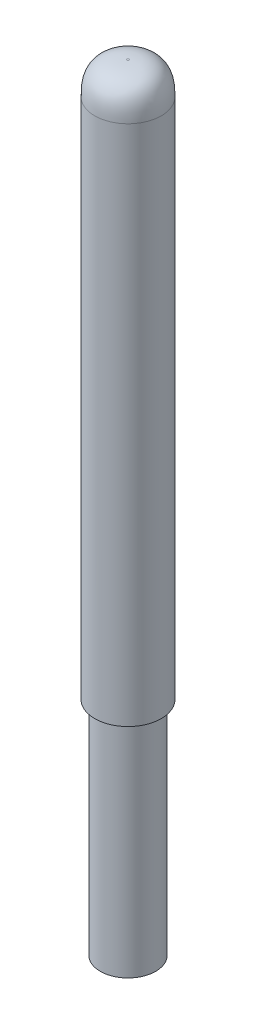
ISO-10303-21;
HEADER;
FILE_DESCRIPTION(('STEP AP214'),'2;1');
FILE_NAME('part.step','',(''),(''),'','','');
FILE_SCHEMA(('AUTOMOTIVE_DESIGN { 1 0 10303 214 1 1 1 1 }'));
ENDSEC;
DATA;
#1=APPLICATION_CONTEXT('core data for automotive mechanical design processes');
#2=APPLICATION_PROTOCOL_DEFINITION('international standard','automotive_design',2000,#1);
#3=PRODUCT_CONTEXT('',#1,'mechanical');
#4=PRODUCT('Part','Part','',(#3));
#5=PRODUCT_RELATED_PRODUCT_CATEGORY('part','',(#4));
#6=PRODUCT_DEFINITION_FORMATION('','',#4);
#7=PRODUCT_DEFINITION_CONTEXT('part definition',#1,'design');
#8=PRODUCT_DEFINITION('design','',#6,#7);
#9=PRODUCT_DEFINITION_SHAPE('','',#8);
#10=(LENGTH_UNIT() NAMED_UNIT(*) SI_UNIT(.MILLI.,.METRE.));
#11=(NAMED_UNIT(*) PLANE_ANGLE_UNIT() SI_UNIT($,.RADIAN.));
#12=(NAMED_UNIT(*) SI_UNIT($,.STERADIAN.) SOLID_ANGLE_UNIT());
#13=UNCERTAINTY_MEASURE_WITH_UNIT(LENGTH_MEASURE(1.E-05),#10,'distance_accuracy_value','');
#14=(GEOMETRIC_REPRESENTATION_CONTEXT(3) GLOBAL_UNCERTAINTY_ASSIGNED_CONTEXT((#13)) GLOBAL_UNIT_ASSIGNED_CONTEXT((#10,
#11,#12)) REPRESENTATION_CONTEXT('',''));
#15=CARTESIAN_POINT('',(0.,0.,0.));
#16=DIRECTION('',(0.,0.,1.));
#17=DIRECTION('',(1.,0.,0.));
#18=AXIS2_PLACEMENT_3D('',#15,#16,#17);
#19=CARTESIAN_POINT('',(0.,50.,0.));
#20=DIRECTION('',(0.,-1.,0.));
#21=DIRECTION('',(0.,0.,-1.));
#22=AXIS2_PLACEMENT_3D('',#19,#20,#21);
#23=CYLINDRICAL_SURFACE('',#22,3.);
#24=CARTESIAN_POINT('',(0.,47.1,3.));
#25=CARTESIAN_POINT('',(0.783611624891226,47.1,3.));
#26=CARTESIAN_POINT('',(2.35083487467367,47.1,2.35083487467367));
#27=CARTESIAN_POINT('',(3.32458256266316,47.1,0.));
#28=CARTESIAN_POINT('',(2.35083487467367,47.1,-2.35083487467368));
#29=CARTESIAN_POINT('',(0.,47.1,-3.32458256266316));
#30=CARTESIAN_POINT('',(-2.35083487467368,47.1000000000001,-2.35083487467368));
#31=CARTESIAN_POINT('',(-3.32458256266316,47.1,0.));
#32=CARTESIAN_POINT('',(-2.35083487467368,47.1000000000001,2.35083487467366));
#33=CARTESIAN_POINT('',(-0.783611624891226,47.1,3.));
#34=CARTESIAN_POINT('',(0.,47.1,3.));
#35=B_SPLINE_CURVE_WITH_KNOTS('',3,(#24,#25,#26,#27,#28,#29,#30,#31,#32,#33,#34),.UNSPECIFIED.,
.T.,.F.,(4,1,1,1,1,1,1,1,4),(0.,0.785398163397448,1.5707963267949,2.35619449019234,
3.14159265358979,3.92699081698724,4.71238898038469,5.49778714378214,6.28318530717959),.UNSPECIFIED.);
#36=CARTESIAN_POINT('',(0.,47.1,3.));
#37=VERTEX_POINT('',#36);
#38=EDGE_CURVE('E11',#37,#37,#35,.F.);
#39=ORIENTED_EDGE('',*,*,#38,.T.);
#40=EDGE_LOOP('',(#39));
#41=FACE_BOUND('',#40,.T.);
#42=CARTESIAN_POINT('',(0.,0.,0.));
#43=DIRECTION('',(0.,1.,0.));
#44=DIRECTION('',(0.,0.,1.));
#45=AXIS2_PLACEMENT_3D('',#42,#43,#44);
#46=CIRCLE('',#45,3.);
#47=CARTESIAN_POINT('',(0.,0.,3.));
#48=VERTEX_POINT('',#47);
#49=EDGE_CURVE('E79',#48,#48,#46,.T.);
#50=ORIENTED_EDGE('',*,*,#49,.T.);
#51=EDGE_LOOP('',(#50));
#52=FACE_BOUND('',#51,.T.);
#53=ADVANCED_FACE('F61',(#41,#52),#23,.T.);
#54=CARTESIAN_POINT('',(0.,0.,0.));
#55=DIRECTION('',(0.,1.,0.));
#56=DIRECTION('',(0.,0.,1.));
#57=AXIS2_PLACEMENT_3D('',#54,#55,#56);
#58=PLANE('',#57);
#59=CARTESIAN_POINT('',(0.,0.,0.));
#60=DIRECTION('',(0.,1.,0.));
#61=DIRECTION('',(0.,0.,1.));
#62=AXIS2_PLACEMENT_3D('',#59,#60,#61);
#63=CIRCLE('',#62,2.5);
#64=CARTESIAN_POINT('',(0.,0.,2.5));
#65=VERTEX_POINT('',#64);
#66=EDGE_CURVE('E89',#65,#65,#63,.T.);
#67=ORIENTED_EDGE('',*,*,#66,.T.);
#68=EDGE_LOOP('',(#67));
#69=FACE_BOUND('',#68,.T.);
#70=ORIENTED_EDGE('',*,*,#49,.F.);
#71=EDGE_LOOP('',(#70));
#72=FACE_BOUND('',#71,.T.);
#73=ADVANCED_FACE('F108',(#69,#72),#58,.F.);
#74=CARTESIAN_POINT('',(0.,50.,0.));
#75=DIRECTION('',(0.,1.,0.));
#76=DIRECTION('',(0.,0.,1.));
#77=AXIS2_PLACEMENT_3D('',#74,#75,#76);
#78=PLANE('',#77);
#79=CARTESIAN_POINT('',(0.,50.,0.100000000000001));
#80=CARTESIAN_POINT('',(-0.0261203874963744,50.,0.100000000000001));
#81=CARTESIAN_POINT('',(-0.0783611624891234,50.,0.0783611624891225));
#82=CARTESIAN_POINT('',(-0.110819418755439,50.,0.));
#83=CARTESIAN_POINT('',(-0.0783611624891231,50.,-0.078361162489123));
#84=CARTESIAN_POINT('',(0.,50.,-0.11081941875544));
#85=CARTESIAN_POINT('',(0.0783611624891228,50.,-0.0783611624891231));
#86=CARTESIAN_POINT('',(0.11081941875544,50.,0.));
#87=CARTESIAN_POINT('',(0.078361162489123,50.,0.0783611624891229));
#88=CARTESIAN_POINT('',(0.0261203874963744,50.,0.100000000000001));
#89=CARTESIAN_POINT('',(0.,50.,0.100000000000001));
#90=B_SPLINE_CURVE_WITH_KNOTS('',3,(#79,#80,#81,#82,#83,#84,#85,#86,#87,#88,#89),.UNSPECIFIED.,
.T.,.F.,(4,1,1,1,1,1,1,1,4),(0.,0.785398163397448,1.5707963267949,2.35619449019235,
3.14159265358979,3.92699081698724,4.71238898038469,5.49778714378214,6.28318530717959),.UNSPECIFIED.);
#91=CARTESIAN_POINT('',(0.,50.,0.100000000000001));
#92=VERTEX_POINT('',#91);
#93=EDGE_CURVE('E74',#92,#92,#90,.F.);
#94=ORIENTED_EDGE('',*,*,#93,.T.);
#95=EDGE_LOOP('',(#94));
#96=FACE_BOUND('',#95,.T.);
#97=ADVANCED_FACE('F97',(#96),#78,.T.);
#98=CARTESIAN_POINT('',(0.,-20.,0.));
#99=DIRECTION('',(0.,1.,0.));
#100=DIRECTION('',(0.,0.,1.));
#101=AXIS2_PLACEMENT_3D('',#98,#99,#100);
#102=CYLINDRICAL_SURFACE('',#101,2.5);
#103=CARTESIAN_POINT('',(0.,-20.,0.));
#104=DIRECTION('',(0.,1.,0.));
#105=DIRECTION('',(0.,0.,1.));
#106=AXIS2_PLACEMENT_3D('',#103,#104,#105);
#107=CIRCLE('',#106,2.5);
#108=CARTESIAN_POINT('',(0.,-20.,2.5));
#109=VERTEX_POINT('',#108);
#110=EDGE_CURVE('E84',#109,#109,#107,.T.);
#111=ORIENTED_EDGE('',*,*,#110,.T.);
#112=EDGE_LOOP('',(#111));
#113=FACE_BOUND('',#112,.T.);
#114=ORIENTED_EDGE('',*,*,#66,.F.);
#115=EDGE_LOOP('',(#114));
#116=FACE_BOUND('',#115,.T.);
#117=ADVANCED_FACE('F107',(#113,#116),#102,.T.);
#118=CARTESIAN_POINT('',(0.,-20.,0.));
#119=DIRECTION('',(0.,1.,0.));
#120=DIRECTION('',(0.,0.,1.));
#121=AXIS2_PLACEMENT_3D('',#118,#119,#120);
#122=PLANE('',#121);
#123=ORIENTED_EDGE('',*,*,#110,.F.);
#124=EDGE_LOOP('',(#123));
#125=FACE_BOUND('',#124,.T.);
#126=ADVANCED_FACE('F133',(#125),#122,.F.);
#127=CARTESIAN_POINT('',(0.,50.,0.100000000000001));
#128=CARTESIAN_POINT('',(0.0261203874963744,50.,0.100000000000001));
#129=CARTESIAN_POINT('',(0.078361162489123,50.,0.0783611624891229));
#130=CARTESIAN_POINT('',(0.11081941875544,50.,0.));
#131=CARTESIAN_POINT('',(0.0783611624891228,50.,-0.0783611624891231));
#132=CARTESIAN_POINT('',(0.,50.,-0.11081941875544));
#133=CARTESIAN_POINT('',(-0.0783611624891231,50.,-0.078361162489123));
#134=CARTESIAN_POINT('',(-0.110819418755439,50.,0.));
#135=CARTESIAN_POINT('',(-0.0783611624891234,50.,0.0783611624891225));
#136=CARTESIAN_POINT('',(-0.0261203874963744,50.,0.100000000000001));
#137=CARTESIAN_POINT('',(0.,50.,0.100000000000001));
#138=CARTESIAN_POINT('',(0.,50.,0.587774349448444));
#139=CARTESIAN_POINT('',(0.153528937680226,50.,0.587774349448445));
#140=CARTESIAN_POINT('',(0.460586813040678,50.,0.460586813040678));
#141=CARTESIAN_POINT('',(0.651368117652327,50.,0.));
#142=CARTESIAN_POINT('',(0.460586813040678,50.,-0.460586813040679));
#143=CARTESIAN_POINT('',(0.,50.,-0.651368117652327));
#144=CARTESIAN_POINT('',(-0.460586813040678,50.,-0.460586813040678));
#145=CARTESIAN_POINT('',(-0.651368117652326,50.,0.));
#146=CARTESIAN_POINT('',(-0.46058681304068,50.,0.460586813040675));
#147=CARTESIAN_POINT('',(-0.153528937680226,50.,0.587774349448444));
#148=CARTESIAN_POINT('',(0.,50.,0.587774349448444));
#149=CARTESIAN_POINT('',(0.,50.,1.07554869889689));
#150=CARTESIAN_POINT('',(0.280937487864078,50.,1.07554869889689));
#151=CARTESIAN_POINT('',(0.842812463592233,50.,0.842812463592233));
#152=CARTESIAN_POINT('',(1.19191681654922,50.,0.));
#153=CARTESIAN_POINT('',(0.842812463592232,50.,-0.842812463592235));
#154=CARTESIAN_POINT('',(0.,50.,-1.19191681654921));
#155=CARTESIAN_POINT('',(-0.842812463592234,50.,-0.842812463592234));
#156=CARTESIAN_POINT('',(-1.19191681654921,50.,0.));
#157=CARTESIAN_POINT('',(-0.842812463592237,50.,0.842812463592228));
#158=CARTESIAN_POINT('',(-0.280937487864078,50.,1.07554869889689));
#159=CARTESIAN_POINT('',(0.,50.,1.07554869889689));
#160=CARTESIAN_POINT('',(0.,49.7920934324754,2.15060966544099));
#161=CARTESIAN_POINT('',(0.561747578147663,49.7920934324754,2.15060966544099));
#162=CARTESIAN_POINT('',(1.68524273444299,49.7920934324754,1.68524273444299));
#163=CARTESIAN_POINT('',(2.38329313093999,49.7920934324754,0.));
#164=CARTESIAN_POINT('',(1.68524273444299,49.7920934324754,-1.68524273444299));
#165=CARTESIAN_POINT('',(0.,49.7920934324754,-2.38329313093999));
#166=CARTESIAN_POINT('',(-1.68524273444299,49.7920934324754,-1.68524273444299));
#167=CARTESIAN_POINT('',(-2.38329313093999,49.7920934324753,0.));
#168=CARTESIAN_POINT('',(-1.68524273444299,49.7920934324754,1.68524273444298));
#169=CARTESIAN_POINT('',(-0.561747578147664,49.7920934324754,2.15060966544099));
#170=CARTESIAN_POINT('',(0.,49.7920934324754,2.15060966544099));
#171=CARTESIAN_POINT('',(0.,49.150609665441,2.79209343247536));
#172=CARTESIAN_POINT('',(0.729305623823379,49.150609665441,2.79209343247536));
#173=CARTESIAN_POINT('',(2.18791687147013,49.150609665441,2.18791687147013));
#174=CARTESIAN_POINT('',(3.09418171297797,49.150609665441,0.));
#175=CARTESIAN_POINT('',(2.18791687147013,49.150609665441,-2.18791687147013));
#176=CARTESIAN_POINT('',(0.,49.150609665441,-3.09418171297797));
#177=CARTESIAN_POINT('',(-2.18791687147014,49.150609665441,-2.18791687147013));
#178=CARTESIAN_POINT('',(-3.09418171297797,49.150609665441,0.));
#179=CARTESIAN_POINT('',(-2.18791687147014,49.150609665441,2.18791687147012));
#180=CARTESIAN_POINT('',(-0.729305623823379,49.150609665441,2.79209343247536));
#181=CARTESIAN_POINT('',(0.,49.150609665441,2.79209343247536));
#182=CARTESIAN_POINT('',(0.,48.0755486988969,3.));
#183=CARTESIAN_POINT('',(0.783611624891226,48.0755486988969,3.));
#184=CARTESIAN_POINT('',(2.35083487467367,48.0755486988969,2.35083487467367));
#185=CARTESIAN_POINT('',(3.32458256266316,48.0755486988969,0.));
#186=CARTESIAN_POINT('',(2.35083487467367,48.0755486988969,-2.35083487467368));
#187=CARTESIAN_POINT('',(0.,48.0755486988969,-3.32458256266316));
#188=CARTESIAN_POINT('',(-2.35083487467368,48.0755486988969,-2.35083487467368));
#189=CARTESIAN_POINT('',(-3.32458256266316,48.0755486988969,0.));
#190=CARTESIAN_POINT('',(-2.35083487467369,48.0755486988969,2.35083487467366));
#191=CARTESIAN_POINT('',(-0.783611624891227,48.0755486988969,3.));
#192=CARTESIAN_POINT('',(0.,48.0755486988969,3.));
#193=CARTESIAN_POINT('',(0.,47.5877743494485,3.));
#194=CARTESIAN_POINT('',(0.783611624891226,47.5877743494485,3.));
#195=CARTESIAN_POINT('',(2.35083487467367,47.5877743494485,2.35083487467367));
#196=CARTESIAN_POINT('',(3.32458256266316,47.5877743494484,0.));
#197=CARTESIAN_POINT('',(2.35083487467367,47.5877743494485,-2.35083487467368));
#198=CARTESIAN_POINT('',(0.,47.5877743494484,-3.32458256266316));
#199=CARTESIAN_POINT('',(-2.35083487467368,47.5877743494485,-2.35083487467368));
#200=CARTESIAN_POINT('',(-3.32458256266316,47.5877743494484,0.));
#201=CARTESIAN_POINT('',(-2.35083487467368,47.5877743494485,2.35083487467366));
#202=CARTESIAN_POINT('',(-0.783611624891226,47.5877743494485,3.));
#203=CARTESIAN_POINT('',(0.,47.5877743494485,3.));
#204=CARTESIAN_POINT('',(0.,47.1,3.));
#205=CARTESIAN_POINT('',(0.783611624891226,47.1,3.));
#206=CARTESIAN_POINT('',(2.35083487467367,47.1,2.35083487467367));
#207=CARTESIAN_POINT('',(3.32458256266316,47.1,0.));
#208=CARTESIAN_POINT('',(2.35083487467367,47.1,-2.35083487467368));
#209=CARTESIAN_POINT('',(0.,47.1,-3.32458256266316));
#210=CARTESIAN_POINT('',(-2.35083487467368,47.1,-2.35083487467368));
#211=CARTESIAN_POINT('',(-3.32458256266316,47.1,0.));
#212=CARTESIAN_POINT('',(-2.35083487467368,47.1,2.35083487467366));
#213=CARTESIAN_POINT('',(-0.783611624891226,47.1,3.));
#214=CARTESIAN_POINT('',(0.,47.1,3.));
#215=B_SPLINE_SURFACE_WITH_KNOTS('',5,3,((#127,#128,#129,#130,#131,#132,#133,#134,#135,#136,
#137),(#138,#139,#140,#141,#142,#143,#144,#145,#146,#147,#148),(#149,#150,#151,#152,#153,#154,
#155,#156,#157,#158,#159),(#160,#161,#162,#163,#164,#165,#166,#167,#168,#169,#170),(#171,#172,
#173,#174,#175,#176,#177,#178,#179,#180,#181),(#182,#183,#184,#185,#186,#187,#188,#189,#190,
#191,#192),(#193,#194,#195,#196,#197,#198,#199,#200,#201,#202,#203),(#204,#205,#206,#207,#208,
#209,#210,#211,#212,#213,#214)),.UNSPECIFIED.,.F.,.T.,.F.,(6,2,6),(4,1,1,1,1,1,1,1,4),(0.,0.5,
1.),(0.,0.785398163397448,1.5707963267949,2.35619449019234,3.14159265358979,3.92699081698724,
4.71238898038469,5.49778714378214,6.28318530717959),.UNSPECIFIED.);
#216=ORIENTED_EDGE('',*,*,#38,.F.);
#217=EDGE_LOOP('',(#216));
#218=FACE_BOUND('',#217,.T.);
#219=ORIENTED_EDGE('',*,*,#93,.F.);
#220=EDGE_LOOP('',(#219));
#221=FACE_BOUND('',#220,.T.);
#222=ADVANCED_FACE('F64',(#218,#221),#215,.T.);
#223=CLOSED_SHELL('',(#53,#73,#97,#117,#126,#222));
#224=MANIFOLD_SOLID_BREP('B2',#223);
#225=ADVANCED_BREP_SHAPE_REPRESENTATION('',(#18,#224),#14);
#226=SHAPE_DEFINITION_REPRESENTATION(#9,#225);
ENDSEC;
END-ISO-10303-21;
